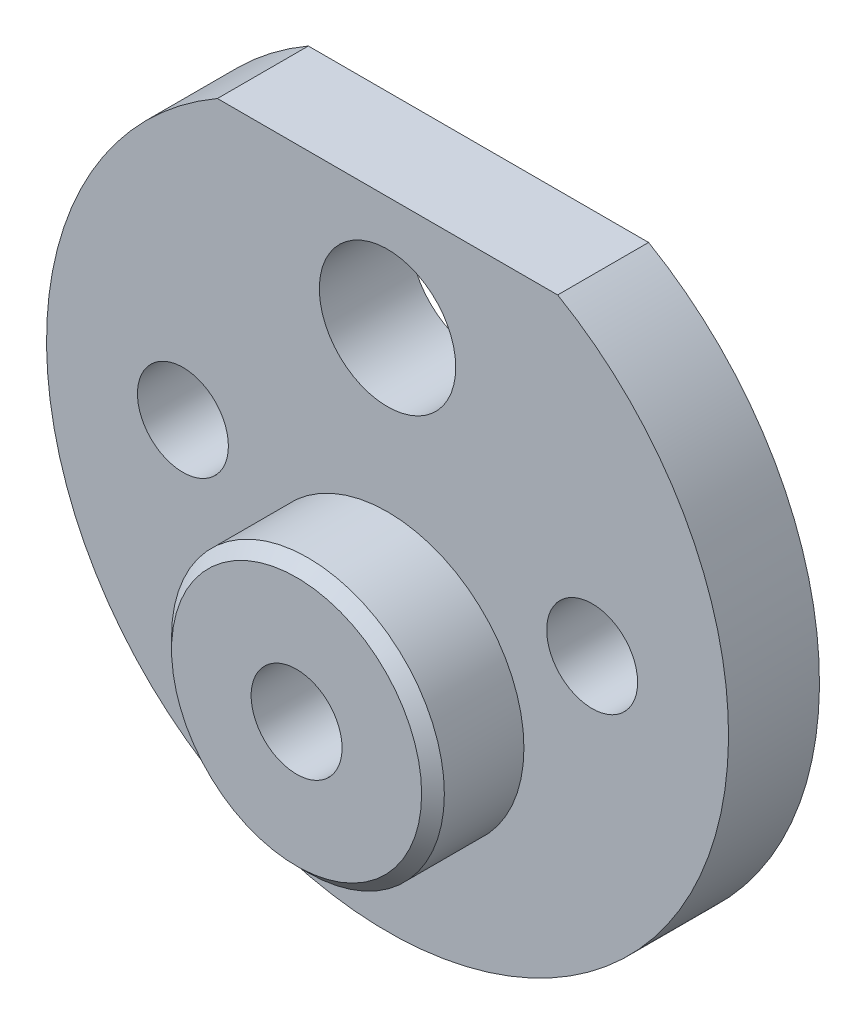
ISO-10303-21;
HEADER;
FILE_DESCRIPTION(('STEP AP214'),'2;1');
FILE_NAME('part.step','',(''),(''),'','','');
FILE_SCHEMA(('AUTOMOTIVE_DESIGN { 1 0 10303 214 1 1 1 1 }'));
ENDSEC;
DATA;
#1=APPLICATION_CONTEXT('core data for automotive mechanical design processes');
#2=APPLICATION_PROTOCOL_DEFINITION('international standard','automotive_design',2000,#1);
#3=PRODUCT_CONTEXT('',#1,'mechanical');
#4=PRODUCT('Part','Part','',(#3));
#5=PRODUCT_RELATED_PRODUCT_CATEGORY('part','',(#4));
#6=PRODUCT_DEFINITION_FORMATION('','',#4);
#7=PRODUCT_DEFINITION_CONTEXT('part definition',#1,'design');
#8=PRODUCT_DEFINITION('design','',#6,#7);
#9=PRODUCT_DEFINITION_SHAPE('','',#8);
#10=(LENGTH_UNIT() NAMED_UNIT(*) SI_UNIT(.MILLI.,.METRE.));
#11=(NAMED_UNIT(*) PLANE_ANGLE_UNIT() SI_UNIT($,.RADIAN.));
#12=(NAMED_UNIT(*) SI_UNIT($,.STERADIAN.) SOLID_ANGLE_UNIT());
#13=UNCERTAINTY_MEASURE_WITH_UNIT(LENGTH_MEASURE(1.E-05),#10,'distance_accuracy_value','');
#14=(GEOMETRIC_REPRESENTATION_CONTEXT(3) GLOBAL_UNCERTAINTY_ASSIGNED_CONTEXT((#13)) GLOBAL_UNIT_ASSIGNED_CONTEXT((#10,
#11,#12)) REPRESENTATION_CONTEXT('',''));
#15=CARTESIAN_POINT('',(0.,0.,0.));
#16=DIRECTION('',(0.,0.,1.));
#17=DIRECTION('',(1.,0.,0.));
#18=AXIS2_PLACEMENT_3D('',#15,#16,#17);
#19=CARTESIAN_POINT('',(0.,0.,4.));
#20=DIRECTION('',(0.,0.,1.));
#21=DIRECTION('',(1.,0.,0.));
#22=AXIS2_PLACEMENT_3D('',#19,#20,#21);
#23=PLANE('',#22);
#24=CARTESIAN_POINT('',(0.,-5.,4.));
#25=DIRECTION('',(0.,0.,1.));
#26=DIRECTION('',(1.,0.,0.));
#27=AXIS2_PLACEMENT_3D('',#24,#25,#26);
#28=CIRCLE('',#27,6.);
#29=CARTESIAN_POINT('',(6.,-5.,4.));
#30=VERTEX_POINT('',#29);
#31=EDGE_CURVE('E194',#30,#30,#28,.T.);
#32=ORIENTED_EDGE('',*,*,#31,.F.);
#33=EDGE_LOOP('',(#32));
#34=FACE_BOUND('',#33,.T.);
#35=CARTESIAN_POINT('',(-9.,0.,4.));
#36=DIRECTION('',(0.,0.,1.));
#37=DIRECTION('',(1.,0.,0.));
#38=AXIS2_PLACEMENT_3D('',#35,#36,#37);
#39=CIRCLE('',#38,2.);
#40=CARTESIAN_POINT('',(-7.,0.,4.));
#41=VERTEX_POINT('',#40);
#42=EDGE_CURVE('E209',#41,#41,#39,.T.);
#43=ORIENTED_EDGE('',*,*,#42,.F.);
#44=EDGE_LOOP('',(#43));
#45=FACE_BOUND('',#44,.T.);
#46=CARTESIAN_POINT('',(0.,0.,4.));
#47=DIRECTION('',(0.,0.,1.));
#48=DIRECTION('',(1.,0.,0.));
#49=AXIS2_PLACEMENT_3D('',#46,#47,#48);
#50=CIRCLE('',#49,15.);
#51=CARTESIAN_POINT('',(-7.48331477354788,13.,4.));
#52=VERTEX_POINT('',#51);
#53=CARTESIAN_POINT('',(7.48331477354788,13.,4.));
#54=VERTEX_POINT('',#53);
#55=EDGE_CURVE('E68',#52,#54,#50,.T.);
#56=ORIENTED_EDGE('',*,*,#55,.T.);
#57=DIRECTION('',(-1.,0.,0.));
#58=VECTOR('',#57,1.);
#59=CARTESIAN_POINT('',(-7.48331477354788,13.,4.));
#60=LINE('',#59,#58);
#61=EDGE_CURVE('E50',#54,#52,#60,.T.);
#62=ORIENTED_EDGE('',*,*,#61,.T.);
#63=EDGE_LOOP('',(#56,#62));
#64=FACE_BOUND('',#63,.T.);
#65=CARTESIAN_POINT('',(0.,8.,4.));
#66=DIRECTION('',(0.,0.,1.));
#67=DIRECTION('',(1.,0.,0.));
#68=AXIS2_PLACEMENT_3D('',#65,#66,#67);
#69=CIRCLE('',#68,3.);
#70=CARTESIAN_POINT('',(3.,8.,4.));
#71=VERTEX_POINT('',#70);
#72=EDGE_CURVE('E76',#71,#71,#69,.T.);
#73=ORIENTED_EDGE('',*,*,#72,.F.);
#74=EDGE_LOOP('',(#73));
#75=FACE_BOUND('',#74,.T.);
#76=CARTESIAN_POINT('',(9.,0.,4.));
#77=DIRECTION('',(0.,0.,1.));
#78=DIRECTION('',(1.,0.,0.));
#79=AXIS2_PLACEMENT_3D('',#76,#77,#78);
#80=CIRCLE('',#79,2.);
#81=CARTESIAN_POINT('',(11.,0.,4.));
#82=VERTEX_POINT('',#81);
#83=EDGE_CURVE('E199',#82,#82,#80,.T.);
#84=ORIENTED_EDGE('',*,*,#83,.F.);
#85=EDGE_LOOP('',(#84));
#86=FACE_BOUND('',#85,.T.);
#87=ADVANCED_FACE('F34',(#34,#45,#64,#75,#86),#23,.T.);
#88=CARTESIAN_POINT('',(0.,0.,0.));
#89=DIRECTION('',(0.,0.,1.));
#90=DIRECTION('',(1.,0.,0.));
#91=AXIS2_PLACEMENT_3D('',#88,#89,#90);
#92=PLANE('',#91);
#93=CARTESIAN_POINT('',(0.,-5.,0.));
#94=DIRECTION('',(0.,0.,1.));
#95=DIRECTION('',(1.,0.,0.));
#96=AXIS2_PLACEMENT_3D('',#93,#94,#95);
#97=CIRCLE('',#96,2.);
#98=CARTESIAN_POINT('',(2.,-5.,0.));
#99=VERTEX_POINT('',#98);
#100=EDGE_CURVE('E196',#99,#99,#97,.T.);
#101=ORIENTED_EDGE('',*,*,#100,.T.);
#102=EDGE_LOOP('',(#101));
#103=FACE_BOUND('',#102,.T.);
#104=CARTESIAN_POINT('',(0.,0.,0.));
#105=DIRECTION('',(0.,0.,1.));
#106=DIRECTION('',(1.,0.,0.));
#107=AXIS2_PLACEMENT_3D('',#104,#105,#106);
#108=CIRCLE('',#107,15.);
#109=CARTESIAN_POINT('',(-7.48331477354788,13.,0.));
#110=VERTEX_POINT('',#109);
#111=CARTESIAN_POINT('',(7.48331477354788,13.,0.));
#112=VERTEX_POINT('',#111);
#113=EDGE_CURVE('E69',#110,#112,#108,.T.);
#114=ORIENTED_EDGE('',*,*,#113,.F.);
#115=DIRECTION('',(-1.,0.,0.));
#116=VECTOR('',#115,1.);
#117=CARTESIAN_POINT('',(-7.48331477354788,13.,0.));
#118=LINE('',#117,#116);
#119=EDGE_CURVE('E58',#112,#110,#118,.T.);
#120=ORIENTED_EDGE('',*,*,#119,.F.);
#121=EDGE_LOOP('',(#114,#120));
#122=FACE_BOUND('',#121,.T.);
#123=CARTESIAN_POINT('',(0.,8.,0.));
#124=DIRECTION('',(0.,0.,1.));
#125=DIRECTION('',(1.,0.,0.));
#126=AXIS2_PLACEMENT_3D('',#123,#124,#125);
#127=CIRCLE('',#126,3.);
#128=CARTESIAN_POINT('',(3.,8.,0.));
#129=VERTEX_POINT('',#128);
#130=EDGE_CURVE('E79',#129,#129,#127,.T.);
#131=ORIENTED_EDGE('',*,*,#130,.T.);
#132=EDGE_LOOP('',(#131));
#133=FACE_BOUND('',#132,.T.);
#134=CARTESIAN_POINT('',(-9.,0.,0.));
#135=DIRECTION('',(0.,0.,1.));
#136=DIRECTION('',(1.,0.,0.));
#137=AXIS2_PLACEMENT_3D('',#134,#135,#136);
#138=CIRCLE('',#137,2.);
#139=CARTESIAN_POINT('',(-7.,0.,0.));
#140=VERTEX_POINT('',#139);
#141=EDGE_CURVE('E207',#140,#140,#138,.T.);
#142=ORIENTED_EDGE('',*,*,#141,.T.);
#143=EDGE_LOOP('',(#142));
#144=FACE_BOUND('',#143,.T.);
#145=CARTESIAN_POINT('',(9.,0.,0.));
#146=DIRECTION('',(0.,0.,1.));
#147=DIRECTION('',(1.,0.,0.));
#148=AXIS2_PLACEMENT_3D('',#145,#146,#147);
#149=CIRCLE('',#148,2.);
#150=CARTESIAN_POINT('',(11.,0.,0.));
#151=VERTEX_POINT('',#150);
#152=EDGE_CURVE('E195',#151,#151,#149,.T.);
#153=ORIENTED_EDGE('',*,*,#152,.T.);
#154=EDGE_LOOP('',(#153));
#155=FACE_BOUND('',#154,.T.);
#156=ADVANCED_FACE('F74',(#103,#122,#133,#144,#155),#92,.F.);
#157=CARTESIAN_POINT('',(0.,0.,4.));
#158=DIRECTION('',(0.,0.,-1.));
#159=DIRECTION('',(-1.,0.,0.));
#160=AXIS2_PLACEMENT_3D('',#157,#158,#159);
#161=CYLINDRICAL_SURFACE('',#160,15.);
#162=ORIENTED_EDGE('',*,*,#113,.T.);
#163=DIRECTION('',(0.,0.,-1.));
#164=VECTOR('',#163,1.);
#165=CARTESIAN_POINT('',(7.48331477354788,13.,4.));
#166=LINE('',#165,#164);
#167=EDGE_CURVE('E66',#54,#112,#166,.T.);
#168=ORIENTED_EDGE('',*,*,#167,.F.);
#169=ORIENTED_EDGE('',*,*,#55,.F.);
#170=DIRECTION('',(0.,0.,-1.));
#171=VECTOR('',#170,1.);
#172=CARTESIAN_POINT('',(-7.48331477354788,13.,4.));
#173=LINE('',#172,#171);
#174=EDGE_CURVE('E63',#52,#110,#173,.T.);
#175=ORIENTED_EDGE('',*,*,#174,.T.);
#176=EDGE_LOOP('',(#162,#168,#169,#175));
#177=FACE_BOUND('',#176,.T.);
#178=ADVANCED_FACE('F72',(#177),#161,.T.);
#179=CARTESIAN_POINT('',(-7.48331477354788,13.,4.));
#180=DIRECTION('',(0.,-1.,0.));
#181=DIRECTION('',(0.,0.,-1.));
#182=AXIS2_PLACEMENT_3D('',#179,#180,#181);
#183=PLANE('',#182);
#184=ORIENTED_EDGE('',*,*,#119,.T.);
#185=ORIENTED_EDGE('',*,*,#174,.F.);
#186=ORIENTED_EDGE('',*,*,#61,.F.);
#187=ORIENTED_EDGE('',*,*,#167,.T.);
#188=EDGE_LOOP('',(#184,#185,#186,#187));
#189=FACE_BOUND('',#188,.T.);
#190=ADVANCED_FACE('F62',(#189),#183,.F.);
#191=CARTESIAN_POINT('',(0.,8.,4.));
#192=DIRECTION('',(0.,0.,-1.));
#193=DIRECTION('',(-1.,0.,0.));
#194=AXIS2_PLACEMENT_3D('',#191,#192,#193);
#195=CYLINDRICAL_SURFACE('',#194,3.);
#196=ORIENTED_EDGE('',*,*,#72,.T.);
#197=EDGE_LOOP('',(#196));
#198=FACE_BOUND('',#197,.T.);
#199=ORIENTED_EDGE('',*,*,#130,.F.);
#200=EDGE_LOOP('',(#199));
#201=FACE_BOUND('',#200,.T.);
#202=ADVANCED_FACE('F110',(#198,#201),#195,.F.);
#203=CARTESIAN_POINT('',(-9.,0.,4.));
#204=DIRECTION('',(0.,0.,-1.));
#205=DIRECTION('',(-1.,0.,0.));
#206=AXIS2_PLACEMENT_3D('',#203,#204,#205);
#207=CYLINDRICAL_SURFACE('',#206,2.);
#208=ORIENTED_EDGE('',*,*,#42,.T.);
#209=EDGE_LOOP('',(#208));
#210=FACE_BOUND('',#209,.T.);
#211=ORIENTED_EDGE('',*,*,#141,.F.);
#212=EDGE_LOOP('',(#211));
#213=FACE_BOUND('',#212,.T.);
#214=ADVANCED_FACE('F129',(#210,#213),#207,.F.);
#215=CARTESIAN_POINT('',(9.,0.,4.));
#216=DIRECTION('',(0.,0.,-1.));
#217=DIRECTION('',(-1.,0.,0.));
#218=AXIS2_PLACEMENT_3D('',#215,#216,#217);
#219=CYLINDRICAL_SURFACE('',#218,2.);
#220=ORIENTED_EDGE('',*,*,#83,.T.);
#221=EDGE_LOOP('',(#220));
#222=FACE_BOUND('',#221,.T.);
#223=ORIENTED_EDGE('',*,*,#152,.F.);
#224=EDGE_LOOP('',(#223));
#225=FACE_BOUND('',#224,.T.);
#226=ADVANCED_FACE('F136',(#222,#225),#219,.F.);
#227=CARTESIAN_POINT('',(0.,-5.,8.));
#228=DIRECTION('',(0.,0.,-1.));
#229=DIRECTION('',(-1.,0.,0.));
#230=AXIS2_PLACEMENT_3D('',#227,#228,#229);
#231=CYLINDRICAL_SURFACE('',#230,6.);
#232=CARTESIAN_POINT('',(0.,-5.,7.5));
#233=DIRECTION('',(0.,0.,1.));
#234=DIRECTION('',(1.,0.,0.));
#235=AXIS2_PLACEMENT_3D('',#232,#233,#234);
#236=CIRCLE('',#235,6.);
#237=CARTESIAN_POINT('',(6.,-5.,7.5));
#238=VERTEX_POINT('',#237);
#239=EDGE_CURVE('E11',#238,#238,#236,.F.);
#240=ORIENTED_EDGE('',*,*,#239,.T.);
#241=EDGE_LOOP('',(#240));
#242=FACE_BOUND('',#241,.T.);
#243=ORIENTED_EDGE('',*,*,#31,.T.);
#244=EDGE_LOOP('',(#243));
#245=FACE_BOUND('',#244,.T.);
#246=ADVANCED_FACE('F143',(#242,#245),#231,.T.);
#247=CARTESIAN_POINT('',(0.,-5.,8.));
#248=DIRECTION('',(0.,0.,1.));
#249=DIRECTION('',(1.,0.,0.));
#250=AXIS2_PLACEMENT_3D('',#247,#248,#249);
#251=PLANE('',#250);
#252=CARTESIAN_POINT('',(0.,-5.,8.));
#253=DIRECTION('',(0.,0.,1.));
#254=DIRECTION('',(1.,0.,0.));
#255=AXIS2_PLACEMENT_3D('',#252,#253,#254);
#256=CIRCLE('',#255,5.50000000000001);
#257=CARTESIAN_POINT('',(5.50000000000001,-5.,8.));
#258=VERTEX_POINT('',#257);
#259=EDGE_CURVE('E43',#258,#258,#256,.T.);
#260=ORIENTED_EDGE('',*,*,#259,.T.);
#261=EDGE_LOOP('',(#260));
#262=FACE_BOUND('',#261,.T.);
#263=CARTESIAN_POINT('',(0.,-5.,8.));
#264=DIRECTION('',(0.,0.,1.));
#265=DIRECTION('',(1.,0.,0.));
#266=AXIS2_PLACEMENT_3D('',#263,#264,#265);
#267=CIRCLE('',#266,2.);
#268=CARTESIAN_POINT('',(2.,-5.,8.));
#269=VERTEX_POINT('',#268);
#270=EDGE_CURVE('E202',#269,#269,#267,.T.);
#271=ORIENTED_EDGE('',*,*,#270,.F.);
#272=EDGE_LOOP('',(#271));
#273=FACE_BOUND('',#272,.T.);
#274=ADVANCED_FACE('F87',(#262,#273),#251,.T.);
#275=CARTESIAN_POINT('',(0.,-5.,0.));
#276=DIRECTION('',(0.,0.,1.));
#277=DIRECTION('',(1.,0.,0.));
#278=AXIS2_PLACEMENT_3D('',#275,#276,#277);
#279=CYLINDRICAL_SURFACE('',#278,2.);
#280=ORIENTED_EDGE('',*,*,#100,.F.);
#281=EDGE_LOOP('',(#280));
#282=FACE_BOUND('',#281,.T.);
#283=ORIENTED_EDGE('',*,*,#270,.T.);
#284=EDGE_LOOP('',(#283));
#285=FACE_BOUND('',#284,.T.);
#286=ADVANCED_FACE('F91',(#282,#285),#279,.F.);
#287=CARTESIAN_POINT('',(0.,-5.,8.));
#288=DIRECTION('',(0.,0.,-1.));
#289=DIRECTION('',(-1.,0.,0.));
#290=AXIS2_PLACEMENT_3D('',#287,#288,#289);
#291=CONICAL_SURFACE('',#290,5.50000000000001,0.785398163397447);
#292=ORIENTED_EDGE('',*,*,#239,.F.);
#293=EDGE_LOOP('',(#292));
#294=FACE_BOUND('',#293,.T.);
#295=ORIENTED_EDGE('',*,*,#259,.F.);
#296=EDGE_LOOP('',(#295));
#297=FACE_BOUND('',#296,.T.);
#298=ADVANCED_FACE('F36',(#294,#297),#291,.T.);
#299=CLOSED_SHELL('',(#87,#156,#178,#190,#202,#214,#226,#246,#274,#286,#298));
#300=MANIFOLD_SOLID_BREP('B2',#299);
#301=ADVANCED_BREP_SHAPE_REPRESENTATION('',(#18,#300),#14);
#302=SHAPE_DEFINITION_REPRESENTATION(#9,#301);
ENDSEC;
END-ISO-10303-21;
